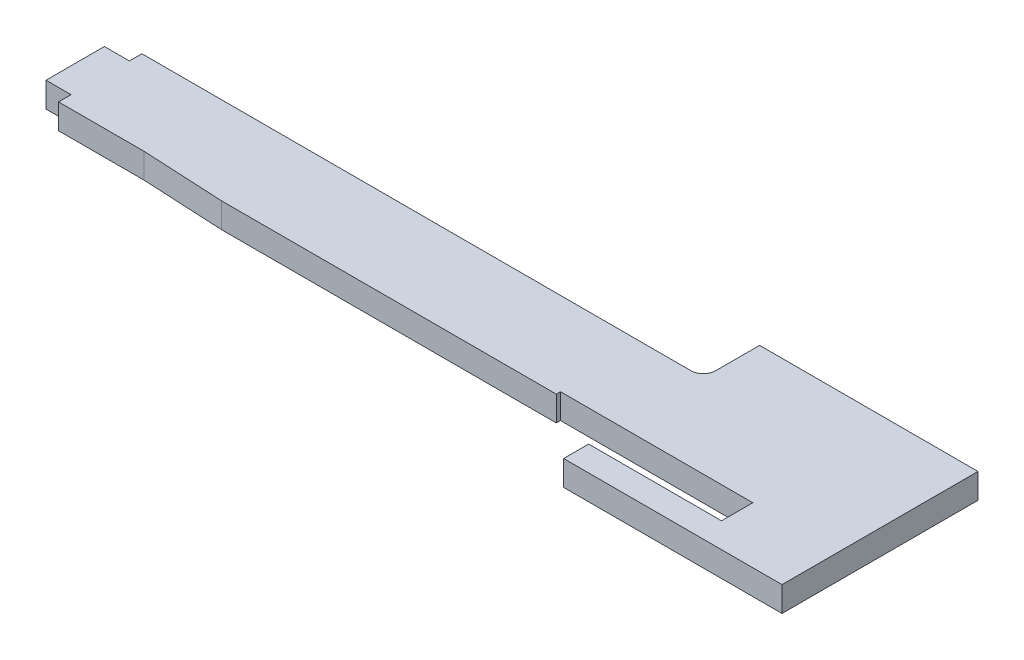
ISO-10303-21;
HEADER;
FILE_DESCRIPTION(('STEP AP214'),'2;1');
FILE_NAME('part.step','',(''),(''),'','','');
FILE_SCHEMA(('AUTOMOTIVE_DESIGN { 1 0 10303 214 1 1 1 1 }'));
ENDSEC;
DATA;
#1=APPLICATION_CONTEXT('core data for automotive mechanical design processes');
#2=APPLICATION_PROTOCOL_DEFINITION('international standard','automotive_design',2000,#1);
#3=PRODUCT_CONTEXT('',#1,'mechanical');
#4=PRODUCT('Part','Part','',(#3));
#5=PRODUCT_RELATED_PRODUCT_CATEGORY('part','',(#4));
#6=PRODUCT_DEFINITION_FORMATION('','',#4);
#7=PRODUCT_DEFINITION_CONTEXT('part definition',#1,'design');
#8=PRODUCT_DEFINITION('design','',#6,#7);
#9=PRODUCT_DEFINITION_SHAPE('','',#8);
#10=(LENGTH_UNIT() NAMED_UNIT(*) SI_UNIT(.MILLI.,.METRE.));
#11=(NAMED_UNIT(*) PLANE_ANGLE_UNIT() SI_UNIT($,.RADIAN.));
#12=(NAMED_UNIT(*) SI_UNIT($,.STERADIAN.) SOLID_ANGLE_UNIT());
#13=UNCERTAINTY_MEASURE_WITH_UNIT(LENGTH_MEASURE(1.E-05),#10,'distance_accuracy_value','');
#14=(GEOMETRIC_REPRESENTATION_CONTEXT(3) GLOBAL_UNCERTAINTY_ASSIGNED_CONTEXT((#13)) GLOBAL_UNIT_ASSIGNED_CONTEXT((#10,
#11,#12)) REPRESENTATION_CONTEXT('',''));
#15=CARTESIAN_POINT('',(0.,0.,0.));
#16=DIRECTION('',(0.,0.,1.));
#17=DIRECTION('',(1.,0.,0.));
#18=AXIS2_PLACEMENT_3D('',#15,#16,#17);
#19=CARTESIAN_POINT('',(-50.3732758055503,-114.131105205181,11.));
#20=DIRECTION('',(0.,0.,1.));
#21=DIRECTION('',(1.,0.,0.));
#22=AXIS2_PLACEMENT_3D('',#19,#20,#21);
#23=PLANE('',#22);
#24=DIRECTION('',(1.,0.,0.));
#25=VECTOR('',#24,1.);
#26=CARTESIAN_POINT('',(-50.3732758055503,0.,11.));
#27=LINE('',#26,#25);
#28=CARTESIAN_POINT('',(-50.3732758055503,0.,11.));
#29=VERTEX_POINT('',#28);
#30=CARTESIAN_POINT('',(29.8732758055504,0.,11.));
#31=VERTEX_POINT('',#30);
#32=EDGE_CURVE('E219',#29,#31,#27,.T.);
#33=ORIENTED_EDGE('',*,*,#32,.T.);
#34=DIRECTION('',(0.,1.,0.));
#35=VECTOR('',#34,1.);
#36=CARTESIAN_POINT('',(29.8732758055504,0.,11.));
#37=LINE('',#36,#35);
#38=CARTESIAN_POINT('',(29.8732758055503,6.00000000000001,11.));
#39=VERTEX_POINT('',#38);
#40=EDGE_CURVE('E172',#31,#39,#37,.T.);
#41=ORIENTED_EDGE('',*,*,#40,.T.);
#42=DIRECTION('',(1.,0.,0.));
#43=VECTOR('',#42,1.);
#44=CARTESIAN_POINT('',(-50.3732758055503,6.00000000000001,11.));
#45=LINE('',#44,#43);
#46=CARTESIAN_POINT('',(-50.3732758055503,6.00000000000001,11.));
#47=VERTEX_POINT('',#46);
#48=EDGE_CURVE('E210',#47,#39,#45,.T.);
#49=ORIENTED_EDGE('',*,*,#48,.F.);
#50=DIRECTION('',(0.,1.,0.));
#51=VECTOR('',#50,1.);
#52=CARTESIAN_POINT('',(-50.3732758055503,-114.131105205181,11.));
#53=LINE('',#52,#51);
#54=EDGE_CURVE('E218',#29,#47,#53,.T.);
#55=ORIENTED_EDGE('',*,*,#54,.F.);
#56=EDGE_LOOP('',(#33,#41,#49,#55));
#57=FACE_BOUND('',#56,.T.);
#58=ADVANCED_FACE('F37',(#57),#23,.T.);
#59=CARTESIAN_POINT('',(-96.5,6.00000000000001,-23.5));
#60=DIRECTION('',(1.,0.,0.));
#61=DIRECTION('',(0.,0.,-1.));
#62=AXIS2_PLACEMENT_3D('',#59,#60,#61);
#63=PLANE('',#62);
#64=DIRECTION('',(0.,1.,0.));
#65=VECTOR('',#64,1.);
#66=CARTESIAN_POINT('',(-96.5,0.,-7.));
#67=LINE('',#66,#65);
#68=CARTESIAN_POINT('',(-96.5,0.,-7.));
#69=VERTEX_POINT('',#68);
#70=CARTESIAN_POINT('',(-96.5,6.00000000000001,-7.));
#71=VERTEX_POINT('',#70);
#72=EDGE_CURVE('E238',#69,#71,#67,.T.);
#73=ORIENTED_EDGE('',*,*,#72,.F.);
#74=DIRECTION('',(0.,0.,1.));
#75=VECTOR('',#74,1.);
#76=CARTESIAN_POINT('',(-96.5,0.,-23.5));
#77=LINE('',#76,#75);
#78=CARTESIAN_POINT('',(-96.5,0.,7.));
#79=VERTEX_POINT('',#78);
#80=EDGE_CURVE('E289',#69,#79,#77,.T.);
#81=ORIENTED_EDGE('',*,*,#80,.T.);
#82=DIRECTION('',(0.,1.,0.));
#83=VECTOR('',#82,1.);
#84=CARTESIAN_POINT('',(-96.5,0.,7.));
#85=LINE('',#84,#83);
#86=CARTESIAN_POINT('',(-96.5,6.00000000000001,7.));
#87=VERTEX_POINT('',#86);
#88=EDGE_CURVE('E258',#79,#87,#85,.T.);
#89=ORIENTED_EDGE('',*,*,#88,.T.);
#90=DIRECTION('',(0.,0.,1.));
#91=VECTOR('',#90,1.);
#92=CARTESIAN_POINT('',(-96.5,6.00000000000001,-23.5));
#93=LINE('',#92,#91);
#94=EDGE_CURVE('E294',#71,#87,#93,.T.);
#95=ORIENTED_EDGE('',*,*,#94,.F.);
#96=EDGE_LOOP('',(#73,#81,#89,#95));
#97=FACE_BOUND('',#96,.T.);
#98=ADVANCED_FACE('F373',(#97),#63,.F.);
#99=CARTESIAN_POINT('',(-96.5,6.00000000000001,23.5));
#100=DIRECTION('',(0.,0.,-1.));
#101=DIRECTION('',(-1.,0.,0.));
#102=AXIS2_PLACEMENT_3D('',#99,#100,#101);
#103=PLANE('',#102);
#104=DIRECTION('',(0.,1.,0.));
#105=VECTOR('',#104,1.);
#106=CARTESIAN_POINT('',(44.1267241944497,0.,23.5));
#107=LINE('',#106,#105);
#108=CARTESIAN_POINT('',(44.1267241944497,0.,23.5));
#109=VERTEX_POINT('',#108);
#110=CARTESIAN_POINT('',(44.1267241944497,6.00000000000001,23.5));
#111=VERTEX_POINT('',#110);
#112=EDGE_CURVE('E235',#109,#111,#107,.T.);
#113=ORIENTED_EDGE('',*,*,#112,.F.);
#114=DIRECTION('',(1.,0.,0.));
#115=VECTOR('',#114,1.);
#116=CARTESIAN_POINT('',(-96.5,0.,23.5));
#117=LINE('',#116,#115);
#118=CARTESIAN_POINT('',(96.5,0.,23.5));
#119=VERTEX_POINT('',#118);
#120=EDGE_CURVE('E302',#109,#119,#117,.T.);
#121=ORIENTED_EDGE('',*,*,#120,.T.);
#122=DIRECTION('',(0.,-1.,0.));
#123=VECTOR('',#122,1.);
#124=CARTESIAN_POINT('',(96.5,6.00000000000001,23.5));
#125=LINE('',#124,#123);
#126=CARTESIAN_POINT('',(96.5,6.00000000000001,23.5));
#127=VERTEX_POINT('',#126);
#128=EDGE_CURVE('E306',#127,#119,#125,.T.);
#129=ORIENTED_EDGE('',*,*,#128,.F.);
#130=DIRECTION('',(1.,0.,0.));
#131=VECTOR('',#130,1.);
#132=CARTESIAN_POINT('',(-96.5,6.00000000000001,23.5));
#133=LINE('',#132,#131);
#134=EDGE_CURVE('E292',#111,#127,#133,.T.);
#135=ORIENTED_EDGE('',*,*,#134,.F.);
#136=EDGE_LOOP('',(#113,#121,#129,#135));
#137=FACE_BOUND('',#136,.T.);
#138=ADVANCED_FACE('F342',(#137),#103,.F.);
#139=CARTESIAN_POINT('',(0.,6.00000000000001,0.));
#140=DIRECTION('',(0.,-1.,0.));
#141=DIRECTION('',(0.,0.,-1.));
#142=AXIS2_PLACEMENT_3D('',#139,#140,#141);
#143=PLANE('',#142);
#144=DIRECTION('',(0.,0.,-1.));
#145=VECTOR('',#144,1.);
#146=CARTESIAN_POINT('',(76.,6.00000000000001,0.));
#147=LINE('',#146,#145);
#148=CARTESIAN_POINT('',(76.,6.00000000000001,17.5));
#149=VERTEX_POINT('',#148);
#150=CARTESIAN_POINT('',(76.,6.00000000000001,10.));
#151=VERTEX_POINT('',#150);
#152=EDGE_CURVE('E190',#149,#151,#147,.T.);
#153=ORIENTED_EDGE('',*,*,#152,.F.);
#154=DIRECTION('',(1.,0.,0.));
#155=VECTOR('',#154,1.);
#156=CARTESIAN_POINT('',(0.,6.00000000000001,17.5));
#157=LINE('',#156,#155);
#158=CARTESIAN_POINT('',(44.1267241944497,6.00000000000001,17.5));
#159=VERTEX_POINT('',#158);
#160=EDGE_CURVE('E193',#159,#149,#157,.T.);
#161=ORIENTED_EDGE('',*,*,#160,.F.);
#162=DIRECTION('',(0.,0.,-1.));
#163=VECTOR('',#162,1.);
#164=CARTESIAN_POINT('',(44.1267241944497,6.00000000000001,9.99999999999999));
#165=LINE('',#164,#163);
#166=EDGE_CURVE('E269',#111,#159,#165,.T.);
#167=ORIENTED_EDGE('',*,*,#166,.F.);
#168=ORIENTED_EDGE('',*,*,#134,.T.);
#169=DIRECTION('',(0.,0.,1.));
#170=VECTOR('',#169,1.);
#171=CARTESIAN_POINT('',(96.5,6.00000000000001,-23.5));
#172=LINE('',#171,#170);
#173=CARTESIAN_POINT('',(96.5,6.00000000000001,-23.5));
#174=VERTEX_POINT('',#173);
#175=EDGE_CURVE('E288',#174,#127,#172,.T.);
#176=ORIENTED_EDGE('',*,*,#175,.F.);
#177=DIRECTION('',(1.,0.,0.));
#178=VECTOR('',#177,1.);
#179=CARTESIAN_POINT('',(-96.5,6.00000000000001,-23.5));
#180=LINE('',#179,#178);
#181=CARTESIAN_POINT('',(44.1267241944497,6.00000000000001,-23.5));
#182=VERTEX_POINT('',#181);
#183=EDGE_CURVE('E286',#182,#174,#180,.T.);
#184=ORIENTED_EDGE('',*,*,#183,.F.);
#185=DIRECTION('',(0.,0.,-1.));
#186=VECTOR('',#185,1.);
#187=CARTESIAN_POINT('',(44.1267241944497,6.00000000000001,-17.5));
#188=LINE('',#187,#186);
#189=CARTESIAN_POINT('',(44.1267241944497,6.00000000000001,-13.));
#190=VERTEX_POINT('',#189);
#191=EDGE_CURVE('E272',#190,#182,#188,.T.);
#192=ORIENTED_EDGE('',*,*,#191,.F.);
#193=CARTESIAN_POINT('',(41.1267241944497,6.00000000000001,-13.));
#194=DIRECTION('',(0.,-1.,0.));
#195=DIRECTION('',(0.,0.,-1.));
#196=AXIS2_PLACEMENT_3D('',#193,#194,#195);
#197=CIRCLE('',#196,3.);
#198=CARTESIAN_POINT('',(41.1267241944497,6.00000000000001,-10.));
#199=VERTEX_POINT('',#198);
#200=EDGE_CURVE('E45',#190,#199,#197,.T.);
#201=ORIENTED_EDGE('',*,*,#200,.T.);
#202=DIRECTION('',(1.,0.,0.));
#203=VECTOR('',#202,1.);
#204=CARTESIAN_POINT('',(-90.5,6.00000000000001,-10.));
#205=LINE('',#204,#203);
#206=CARTESIAN_POINT('',(-90.5,6.00000000000001,-10.));
#207=VERTEX_POINT('',#206);
#208=EDGE_CURVE('E280',#207,#199,#205,.T.);
#209=ORIENTED_EDGE('',*,*,#208,.F.);
#210=DIRECTION('',(0.,0.,1.));
#211=VECTOR('',#210,1.);
#212=CARTESIAN_POINT('',(-90.5,6.00000000000001,0.));
#213=LINE('',#212,#211);
#214=CARTESIAN_POINT('',(-90.5,6.00000000000001,-7.));
#215=VERTEX_POINT('',#214);
#216=EDGE_CURVE('E229',#207,#215,#213,.T.);
#217=ORIENTED_EDGE('',*,*,#216,.T.);
#218=DIRECTION('',(-1.,0.,0.));
#219=VECTOR('',#218,1.);
#220=CARTESIAN_POINT('',(0.,6.00000000000001,-7.));
#221=LINE('',#220,#219);
#222=EDGE_CURVE('E232',#215,#71,#221,.T.);
#223=ORIENTED_EDGE('',*,*,#222,.T.);
#224=ORIENTED_EDGE('',*,*,#94,.T.);
#225=DIRECTION('',(1.,0.,0.));
#226=VECTOR('',#225,1.);
#227=CARTESIAN_POINT('',(0.,6.00000000000001,7.00000000000001));
#228=LINE('',#227,#226);
#229=CARTESIAN_POINT('',(-90.5,6.00000000000001,7.));
#230=VERTEX_POINT('',#229);
#231=EDGE_CURVE('E249',#87,#230,#228,.T.);
#232=ORIENTED_EDGE('',*,*,#231,.T.);
#233=DIRECTION('',(0.,0.,1.));
#234=VECTOR('',#233,1.);
#235=CARTESIAN_POINT('',(-90.5,6.00000000000001,0.));
#236=LINE('',#235,#234);
#237=CARTESIAN_POINT('',(-90.5,6.00000000000001,10.));
#238=VERTEX_POINT('',#237);
#239=EDGE_CURVE('E225',#230,#238,#236,.T.);
#240=ORIENTED_EDGE('',*,*,#239,.T.);
#241=DIRECTION('',(-1.,0.,0.));
#242=VECTOR('',#241,1.);
#243=CARTESIAN_POINT('',(44.1267241944497,6.00000000000001,9.99999999999999));
#244=LINE('',#243,#242);
#245=CARTESIAN_POINT('',(-70.000000000002,6.00000000000001,10.));
#246=VERTEX_POINT('',#245);
#247=EDGE_CURVE('E266',#246,#238,#244,.T.);
#248=ORIENTED_EDGE('',*,*,#247,.F.);
#249=DIRECTION('',(0.998704522725528,0.,0.0508849318322744));
#250=VECTOR('',#249,1.);
#251=CARTESIAN_POINT('',(-70.,6.00000000000001,10.0000000000001));
#252=LINE('',#251,#250);
#253=EDGE_CURVE('E204',#246,#47,#252,.T.);
#254=ORIENTED_EDGE('',*,*,#253,.T.);
#255=ORIENTED_EDGE('',*,*,#48,.T.);
#256=DIRECTION('',(0.,0.,-1.));
#257=VECTOR('',#256,1.);
#258=CARTESIAN_POINT('',(29.8732758055504,6.00000000000001,0.));
#259=LINE('',#258,#257);
#260=CARTESIAN_POINT('',(29.8732758055504,6.00000000000001,10.));
#261=VERTEX_POINT('',#260);
#262=EDGE_CURVE('E52',#39,#261,#259,.T.);
#263=ORIENTED_EDGE('',*,*,#262,.T.);
#264=DIRECTION('',(1.,0.,0.));
#265=VECTOR('',#264,1.);
#266=CARTESIAN_POINT('',(0.,6.00000000000001,9.99999999999999));
#267=LINE('',#266,#265);
#268=EDGE_CURVE('E183',#261,#151,#267,.T.);
#269=ORIENTED_EDGE('',*,*,#268,.T.);
#270=EDGE_LOOP('',(#153,#161,#167,#168,#176,#184,#192,#201,#209,#217,#223,#224,#232,#240,#248,
#254,#255,#263,#269));
#271=FACE_BOUND('',#270,.T.);
#272=ADVANCED_FACE('F318',(#271),#143,.F.);
#273=CARTESIAN_POINT('',(0.,0.,0.));
#274=DIRECTION('',(0.,-1.,0.));
#275=DIRECTION('',(0.,0.,-1.));
#276=AXIS2_PLACEMENT_3D('',#273,#274,#275);
#277=PLANE('',#276);
#278=DIRECTION('',(1.,0.,0.));
#279=VECTOR('',#278,1.);
#280=CARTESIAN_POINT('',(0.,0.,17.5));
#281=LINE('',#280,#279);
#282=CARTESIAN_POINT('',(44.1267241944497,0.,17.5));
#283=VERTEX_POINT('',#282);
#284=CARTESIAN_POINT('',(76.,0.,17.5));
#285=VERTEX_POINT('',#284);
#286=EDGE_CURVE('E176',#283,#285,#281,.T.);
#287=ORIENTED_EDGE('',*,*,#286,.T.);
#288=DIRECTION('',(0.,0.,-1.));
#289=VECTOR('',#288,1.);
#290=CARTESIAN_POINT('',(76.,0.,0.));
#291=LINE('',#290,#289);
#292=CARTESIAN_POINT('',(76.,0.,10.));
#293=VERTEX_POINT('',#292);
#294=EDGE_CURVE('E184',#285,#293,#291,.T.);
#295=ORIENTED_EDGE('',*,*,#294,.T.);
#296=DIRECTION('',(1.,0.,0.));
#297=VECTOR('',#296,1.);
#298=CARTESIAN_POINT('',(0.,0.,9.99999999999999));
#299=LINE('',#298,#297);
#300=CARTESIAN_POINT('',(29.8732758055504,0.,10.));
#301=VERTEX_POINT('',#300);
#302=EDGE_CURVE('E177',#301,#293,#299,.T.);
#303=ORIENTED_EDGE('',*,*,#302,.F.);
#304=DIRECTION('',(0.,0.,-1.));
#305=VECTOR('',#304,1.);
#306=CARTESIAN_POINT('',(29.8732758055504,0.,0.));
#307=LINE('',#306,#305);
#308=EDGE_CURVE('E167',#31,#301,#307,.T.);
#309=ORIENTED_EDGE('',*,*,#308,.F.);
#310=ORIENTED_EDGE('',*,*,#32,.F.);
#311=DIRECTION('',(0.998704522725528,0.,0.0508849318322744));
#312=VECTOR('',#311,1.);
#313=CARTESIAN_POINT('',(-70.,0.,10.0000000000001));
#314=LINE('',#313,#312);
#315=CARTESIAN_POINT('',(-70.,0.,10.0000000000001));
#316=VERTEX_POINT('',#315);
#317=EDGE_CURVE('E213',#316,#29,#314,.T.);
#318=ORIENTED_EDGE('',*,*,#317,.F.);
#319=DIRECTION('',(-1.,0.,0.));
#320=VECTOR('',#319,1.);
#321=CARTESIAN_POINT('',(44.1267241944497,0.,9.99999999999999));
#322=LINE('',#321,#320);
#323=CARTESIAN_POINT('',(-90.5,0.,10.));
#324=VERTEX_POINT('',#323);
#325=EDGE_CURVE('E265',#316,#324,#322,.T.);
#326=ORIENTED_EDGE('',*,*,#325,.T.);
#327=DIRECTION('',(0.,0.,1.));
#328=VECTOR('',#327,1.);
#329=CARTESIAN_POINT('',(-90.5,0.,0.));
#330=LINE('',#329,#328);
#331=CARTESIAN_POINT('',(-90.5,0.,7.));
#332=VERTEX_POINT('',#331);
#333=EDGE_CURVE('E245',#332,#324,#330,.T.);
#334=ORIENTED_EDGE('',*,*,#333,.F.);
#335=DIRECTION('',(1.,0.,0.));
#336=VECTOR('',#335,1.);
#337=CARTESIAN_POINT('',(0.,0.,7.00000000000001));
#338=LINE('',#337,#336);
#339=EDGE_CURVE('E248',#79,#332,#338,.T.);
#340=ORIENTED_EDGE('',*,*,#339,.F.);
#341=ORIENTED_EDGE('',*,*,#80,.F.);
#342=DIRECTION('',(-1.,0.,0.));
#343=VECTOR('',#342,1.);
#344=CARTESIAN_POINT('',(0.,0.,-7.));
#345=LINE('',#344,#343);
#346=CARTESIAN_POINT('',(-90.5,0.,-7.));
#347=VERTEX_POINT('',#346);
#348=EDGE_CURVE('E226',#347,#69,#345,.T.);
#349=ORIENTED_EDGE('',*,*,#348,.F.);
#350=DIRECTION('',(0.,0.,1.));
#351=VECTOR('',#350,1.);
#352=CARTESIAN_POINT('',(-90.5,0.,0.));
#353=LINE('',#352,#351);
#354=CARTESIAN_POINT('',(-90.5,0.,-10.));
#355=VERTEX_POINT('',#354);
#356=EDGE_CURVE('E228',#355,#347,#353,.T.);
#357=ORIENTED_EDGE('',*,*,#356,.F.);
#358=DIRECTION('',(1.,0.,0.));
#359=VECTOR('',#358,1.);
#360=CARTESIAN_POINT('',(-90.5,0.,-10.));
#361=LINE('',#360,#359);
#362=CARTESIAN_POINT('',(41.1267241944497,0.,-10.));
#363=VERTEX_POINT('',#362);
#364=EDGE_CURVE('E279',#355,#363,#361,.T.);
#365=ORIENTED_EDGE('',*,*,#364,.T.);
#366=CARTESIAN_POINT('',(41.1267241944497,0.,-13.));
#367=DIRECTION('',(0.,-1.,0.));
#368=DIRECTION('',(0.,0.,-1.));
#369=AXIS2_PLACEMENT_3D('',#366,#367,#368);
#370=CIRCLE('',#369,3.);
#371=CARTESIAN_POINT('',(44.1267241944497,0.,-13.));
#372=VERTEX_POINT('',#371);
#373=EDGE_CURVE('E11',#363,#372,#370,.F.);
#374=ORIENTED_EDGE('',*,*,#373,.T.);
#375=DIRECTION('',(0.,0.,-1.));
#376=VECTOR('',#375,1.);
#377=CARTESIAN_POINT('',(44.1267241944497,0.,-17.5));
#378=LINE('',#377,#376);
#379=CARTESIAN_POINT('',(44.1267241944497,0.,-23.5));
#380=VERTEX_POINT('',#379);
#381=EDGE_CURVE('E282',#372,#380,#378,.T.);
#382=ORIENTED_EDGE('',*,*,#381,.T.);
#383=DIRECTION('',(1.,0.,0.));
#384=VECTOR('',#383,1.);
#385=CARTESIAN_POINT('',(-96.5,0.,-23.5));
#386=LINE('',#385,#384);
#387=CARTESIAN_POINT('',(96.5,0.,-23.5));
#388=VERTEX_POINT('',#387);
#389=EDGE_CURVE('E276',#380,#388,#386,.T.);
#390=ORIENTED_EDGE('',*,*,#389,.T.);
#391=DIRECTION('',(0.,0.,1.));
#392=VECTOR('',#391,1.);
#393=CARTESIAN_POINT('',(96.5,0.,-23.5));
#394=LINE('',#393,#392);
#395=EDGE_CURVE('E299',#388,#119,#394,.T.);
#396=ORIENTED_EDGE('',*,*,#395,.T.);
#397=ORIENTED_EDGE('',*,*,#120,.F.);
#398=DIRECTION('',(0.,0.,-1.));
#399=VECTOR('',#398,1.);
#400=CARTESIAN_POINT('',(44.1267241944497,0.,9.99999999999999));
#401=LINE('',#400,#399);
#402=EDGE_CURVE('E262',#109,#283,#401,.T.);
#403=ORIENTED_EDGE('',*,*,#402,.T.);
#404=EDGE_LOOP('',(#287,#295,#303,#309,#310,#318,#326,#334,#340,#341,#349,#357,#365,#374,#382,
#390,#396,#397,#403));
#405=FACE_BOUND('',#404,.T.);
#406=ADVANCED_FACE('F188',(#405),#277,.T.);
#407=CARTESIAN_POINT('',(-96.5,6.00000000000001,-23.5));
#408=DIRECTION('',(0.,0.,-1.));
#409=DIRECTION('',(-1.,0.,0.));
#410=AXIS2_PLACEMENT_3D('',#407,#408,#409);
#411=PLANE('',#410);
#412=DIRECTION('',(0.,1.,0.));
#413=VECTOR('',#412,1.);
#414=CARTESIAN_POINT('',(44.1267241944497,0.,-23.5));
#415=LINE('',#414,#413);
#416=EDGE_CURVE('E241',#380,#182,#415,.T.);
#417=ORIENTED_EDGE('',*,*,#416,.T.);
#418=ORIENTED_EDGE('',*,*,#183,.T.);
#419=DIRECTION('',(0.,-1.,0.));
#420=VECTOR('',#419,1.);
#421=CARTESIAN_POINT('',(96.5,6.00000000000001,-23.5));
#422=LINE('',#421,#420);
#423=EDGE_CURVE('E297',#174,#388,#422,.T.);
#424=ORIENTED_EDGE('',*,*,#423,.T.);
#425=ORIENTED_EDGE('',*,*,#389,.F.);
#426=EDGE_LOOP('',(#417,#418,#424,#425));
#427=FACE_BOUND('',#426,.T.);
#428=ADVANCED_FACE('F331',(#427),#411,.T.);
#429=CARTESIAN_POINT('',(96.5,6.00000000000001,-23.5));
#430=DIRECTION('',(1.,0.,0.));
#431=DIRECTION('',(0.,0.,-1.));
#432=AXIS2_PLACEMENT_3D('',#429,#430,#431);
#433=PLANE('',#432);
#434=ORIENTED_EDGE('',*,*,#395,.F.);
#435=ORIENTED_EDGE('',*,*,#423,.F.);
#436=ORIENTED_EDGE('',*,*,#175,.T.);
#437=ORIENTED_EDGE('',*,*,#128,.T.);
#438=EDGE_LOOP('',(#434,#435,#436,#437));
#439=FACE_BOUND('',#438,.T.);
#440=ADVANCED_FACE('F336',(#439),#433,.T.);
#441=CARTESIAN_POINT('',(44.1267241944497,0.,-17.5));
#442=DIRECTION('',(1.,0.,0.));
#443=DIRECTION('',(0.,0.,-1.));
#444=AXIS2_PLACEMENT_3D('',#441,#442,#443);
#445=PLANE('',#444);
#446=ORIENTED_EDGE('',*,*,#381,.F.);
#447=DIRECTION('',(0.,1.,0.));
#448=VECTOR('',#447,1.);
#449=CARTESIAN_POINT('',(44.1267241944497,6.00000000000001,-13.));
#450=LINE('',#449,#448);
#451=EDGE_CURVE('E309',#372,#190,#450,.T.);
#452=ORIENTED_EDGE('',*,*,#451,.T.);
#453=ORIENTED_EDGE('',*,*,#191,.T.);
#454=ORIENTED_EDGE('',*,*,#416,.F.);
#455=EDGE_LOOP('',(#446,#452,#453,#454));
#456=FACE_BOUND('',#455,.T.);
#457=ADVANCED_FACE('F328',(#456),#445,.F.);
#458=CARTESIAN_POINT('',(-90.5,0.,-10.));
#459=DIRECTION('',(0.,0.,1.));
#460=DIRECTION('',(1.,0.,0.));
#461=AXIS2_PLACEMENT_3D('',#458,#459,#460);
#462=PLANE('',#461);
#463=ORIENTED_EDGE('',*,*,#208,.T.);
#464=DIRECTION('',(0.,1.,0.));
#465=VECTOR('',#464,1.);
#466=CARTESIAN_POINT('',(41.1267241944497,0.,-10.));
#467=LINE('',#466,#465);
#468=EDGE_CURVE('E60',#199,#363,#467,.F.);
#469=ORIENTED_EDGE('',*,*,#468,.T.);
#470=ORIENTED_EDGE('',*,*,#364,.F.);
#471=DIRECTION('',(0.,1.,0.));
#472=VECTOR('',#471,1.);
#473=CARTESIAN_POINT('',(-90.5,0.,-10.));
#474=LINE('',#473,#472);
#475=EDGE_CURVE('E240',#355,#207,#474,.T.);
#476=ORIENTED_EDGE('',*,*,#475,.T.);
#477=EDGE_LOOP('',(#463,#469,#470,#476));
#478=FACE_BOUND('',#477,.T.);
#479=ADVANCED_FACE('F322',(#478),#462,.F.);
#480=CARTESIAN_POINT('',(44.1267241944497,0.,9.99999999999999));
#481=DIRECTION('',(1.,0.,0.));
#482=DIRECTION('',(0.,0.,-1.));
#483=AXIS2_PLACEMENT_3D('',#480,#481,#482);
#484=PLANE('',#483);
#485=ORIENTED_EDGE('',*,*,#166,.T.);
#486=DIRECTION('',(0.,1.,0.));
#487=VECTOR('',#486,1.);
#488=CARTESIAN_POINT('',(44.1267241944497,0.,17.5));
#489=LINE('',#488,#487);
#490=EDGE_CURVE('E207',#283,#159,#489,.T.);
#491=ORIENTED_EDGE('',*,*,#490,.F.);
#492=ORIENTED_EDGE('',*,*,#402,.F.);
#493=ORIENTED_EDGE('',*,*,#112,.T.);
#494=EDGE_LOOP('',(#485,#491,#492,#493));
#495=FACE_BOUND('',#494,.T.);
#496=ADVANCED_FACE('F344',(#495),#484,.F.);
#497=CARTESIAN_POINT('',(44.1267241944497,0.,9.99999999999999));
#498=DIRECTION('',(0.,0.,-1.));
#499=DIRECTION('',(-1.,0.,0.));
#500=AXIS2_PLACEMENT_3D('',#497,#498,#499);
#501=PLANE('',#500);
#502=ORIENTED_EDGE('',*,*,#325,.F.);
#503=DIRECTION('',(0.,1.,0.));
#504=VECTOR('',#503,1.);
#505=CARTESIAN_POINT('',(-70.,-114.131105205181,10.0000000000001));
#506=LINE('',#505,#504);
#507=EDGE_CURVE('E221',#316,#246,#506,.T.);
#508=ORIENTED_EDGE('',*,*,#507,.T.);
#509=ORIENTED_EDGE('',*,*,#247,.T.);
#510=DIRECTION('',(0.,1.,0.));
#511=VECTOR('',#510,1.);
#512=CARTESIAN_POINT('',(-90.5,0.,10.));
#513=LINE('',#512,#511);
#514=EDGE_CURVE('E268',#324,#238,#513,.T.);
#515=ORIENTED_EDGE('',*,*,#514,.F.);
#516=EDGE_LOOP('',(#502,#508,#509,#515));
#517=FACE_BOUND('',#516,.T.);
#518=ADVANCED_FACE('F362',(#517),#501,.F.);
#519=CARTESIAN_POINT('',(-90.5,0.,0.));
#520=DIRECTION('',(-1.,0.,0.));
#521=DIRECTION('',(0.,0.,1.));
#522=AXIS2_PLACEMENT_3D('',#519,#520,#521);
#523=PLANE('',#522);
#524=ORIENTED_EDGE('',*,*,#514,.T.);
#525=ORIENTED_EDGE('',*,*,#239,.F.);
#526=DIRECTION('',(0.,1.,0.));
#527=VECTOR('',#526,1.);
#528=CARTESIAN_POINT('',(-90.5,0.,7.));
#529=LINE('',#528,#527);
#530=EDGE_CURVE('E251',#332,#230,#529,.T.);
#531=ORIENTED_EDGE('',*,*,#530,.F.);
#532=ORIENTED_EDGE('',*,*,#333,.T.);
#533=EDGE_LOOP('',(#524,#525,#531,#532));
#534=FACE_BOUND('',#533,.T.);
#535=ADVANCED_FACE('F365',(#534),#523,.T.);
#536=CARTESIAN_POINT('',(0.,0.,7.00000000000001));
#537=DIRECTION('',(0.,0.,1.));
#538=DIRECTION('',(1.,0.,0.));
#539=AXIS2_PLACEMENT_3D('',#536,#537,#538);
#540=PLANE('',#539);
#541=ORIENTED_EDGE('',*,*,#231,.F.);
#542=ORIENTED_EDGE('',*,*,#88,.F.);
#543=ORIENTED_EDGE('',*,*,#339,.T.);
#544=ORIENTED_EDGE('',*,*,#530,.T.);
#545=EDGE_LOOP('',(#541,#542,#543,#544));
#546=FACE_BOUND('',#545,.T.);
#547=ADVANCED_FACE('F369',(#546),#540,.T.);
#548=CARTESIAN_POINT('',(-90.5,0.,0.));
#549=DIRECTION('',(-1.,0.,0.));
#550=DIRECTION('',(0.,0.,1.));
#551=AXIS2_PLACEMENT_3D('',#548,#549,#550);
#552=PLANE('',#551);
#553=ORIENTED_EDGE('',*,*,#475,.F.);
#554=ORIENTED_EDGE('',*,*,#356,.T.);
#555=DIRECTION('',(0.,1.,0.));
#556=VECTOR('',#555,1.);
#557=CARTESIAN_POINT('',(-90.5,0.,-7.));
#558=LINE('',#557,#556);
#559=EDGE_CURVE('E231',#347,#215,#558,.T.);
#560=ORIENTED_EDGE('',*,*,#559,.T.);
#561=ORIENTED_EDGE('',*,*,#216,.F.);
#562=EDGE_LOOP('',(#553,#554,#560,#561));
#563=FACE_BOUND('',#562,.T.);
#564=ADVANCED_FACE('F381',(#563),#552,.T.);
#565=CARTESIAN_POINT('',(0.,0.,-7.));
#566=DIRECTION('',(0.,0.,-1.));
#567=DIRECTION('',(-1.,0.,0.));
#568=AXIS2_PLACEMENT_3D('',#565,#566,#567);
#569=PLANE('',#568);
#570=ORIENTED_EDGE('',*,*,#222,.F.);
#571=ORIENTED_EDGE('',*,*,#559,.F.);
#572=ORIENTED_EDGE('',*,*,#348,.T.);
#573=ORIENTED_EDGE('',*,*,#72,.T.);
#574=EDGE_LOOP('',(#570,#571,#572,#573));
#575=FACE_BOUND('',#574,.T.);
#576=ADVANCED_FACE('F379',(#575),#569,.T.);
#577=CARTESIAN_POINT('',(-70.,-114.131105205181,10.0000000000001));
#578=DIRECTION('',(-0.0508849318322744,0.,0.998704522725528));
#579=DIRECTION('',(0.998704522725528,0.,0.0508849318322744));
#580=AXIS2_PLACEMENT_3D('',#577,#578,#579);
#581=PLANE('',#580);
#582=ORIENTED_EDGE('',*,*,#507,.F.);
#583=ORIENTED_EDGE('',*,*,#317,.T.);
#584=ORIENTED_EDGE('',*,*,#54,.T.);
#585=ORIENTED_EDGE('',*,*,#253,.F.);
#586=EDGE_LOOP('',(#582,#583,#584,#585));
#587=FACE_BOUND('',#586,.T.);
#588=ADVANCED_FACE('F359',(#587),#581,.T.);
#589=CARTESIAN_POINT('',(41.1267241944497,0.,-13.));
#590=DIRECTION('',(0.,-1.,0.));
#591=DIRECTION('',(0.,0.,-1.));
#592=AXIS2_PLACEMENT_3D('',#589,#590,#591);
#593=CYLINDRICAL_SURFACE('',#592,3.);
#594=ORIENTED_EDGE('',*,*,#373,.F.);
#595=ORIENTED_EDGE('',*,*,#468,.F.);
#596=ORIENTED_EDGE('',*,*,#200,.F.);
#597=ORIENTED_EDGE('',*,*,#451,.F.);
#598=EDGE_LOOP('',(#594,#595,#596,#597));
#599=FACE_BOUND('',#598,.T.);
#600=ADVANCED_FACE('F39',(#599),#593,.F.);
#601=CARTESIAN_POINT('',(0.,0.,9.99999999999999));
#602=DIRECTION('',(0.,0.,1.));
#603=DIRECTION('',(1.,0.,0.));
#604=AXIS2_PLACEMENT_3D('',#601,#602,#603);
#605=PLANE('',#604);
#606=ORIENTED_EDGE('',*,*,#268,.F.);
#607=DIRECTION('',(0.,1.,0.));
#608=VECTOR('',#607,1.);
#609=CARTESIAN_POINT('',(29.8732758055504,0.,10.));
#610=LINE('',#609,#608);
#611=EDGE_CURVE('E170',#301,#261,#610,.T.);
#612=ORIENTED_EDGE('',*,*,#611,.F.);
#613=ORIENTED_EDGE('',*,*,#302,.T.);
#614=DIRECTION('',(0.,1.,0.));
#615=VECTOR('',#614,1.);
#616=CARTESIAN_POINT('',(76.,0.,10.));
#617=LINE('',#616,#615);
#618=EDGE_CURVE('E202',#293,#151,#617,.T.);
#619=ORIENTED_EDGE('',*,*,#618,.T.);
#620=EDGE_LOOP('',(#606,#612,#613,#619));
#621=FACE_BOUND('',#620,.T.);
#622=ADVANCED_FACE('F180',(#621),#605,.T.);
#623=CARTESIAN_POINT('',(76.,0.,0.));
#624=DIRECTION('',(1.,0.,0.));
#625=DIRECTION('',(0.,0.,-1.));
#626=AXIS2_PLACEMENT_3D('',#623,#624,#625);
#627=PLANE('',#626);
#628=ORIENTED_EDGE('',*,*,#152,.T.);
#629=ORIENTED_EDGE('',*,*,#618,.F.);
#630=ORIENTED_EDGE('',*,*,#294,.F.);
#631=DIRECTION('',(0.,1.,0.));
#632=VECTOR('',#631,1.);
#633=CARTESIAN_POINT('',(76.,0.,17.5));
#634=LINE('',#633,#632);
#635=EDGE_CURVE('E205',#285,#149,#634,.T.);
#636=ORIENTED_EDGE('',*,*,#635,.T.);
#637=EDGE_LOOP('',(#628,#629,#630,#636));
#638=FACE_BOUND('',#637,.T.);
#639=ADVANCED_FACE('F350',(#638),#627,.F.);
#640=CARTESIAN_POINT('',(0.,0.,17.5));
#641=DIRECTION('',(0.,0.,1.));
#642=DIRECTION('',(1.,0.,0.));
#643=AXIS2_PLACEMENT_3D('',#640,#641,#642);
#644=PLANE('',#643);
#645=ORIENTED_EDGE('',*,*,#160,.T.);
#646=ORIENTED_EDGE('',*,*,#635,.F.);
#647=ORIENTED_EDGE('',*,*,#286,.F.);
#648=ORIENTED_EDGE('',*,*,#490,.T.);
#649=EDGE_LOOP('',(#645,#646,#647,#648));
#650=FACE_BOUND('',#649,.T.);
#651=ADVANCED_FACE('F347',(#650),#644,.F.);
#652=CARTESIAN_POINT('',(29.8732758055504,0.,0.));
#653=DIRECTION('',(1.,0.,0.));
#654=DIRECTION('',(0.,0.,-1.));
#655=AXIS2_PLACEMENT_3D('',#652,#653,#654);
#656=PLANE('',#655);
#657=ORIENTED_EDGE('',*,*,#262,.F.);
#658=ORIENTED_EDGE('',*,*,#40,.F.);
#659=ORIENTED_EDGE('',*,*,#308,.T.);
#660=ORIENTED_EDGE('',*,*,#611,.T.);
#661=EDGE_LOOP('',(#657,#658,#659,#660));
#662=FACE_BOUND('',#661,.T.);
#663=ADVANCED_FACE('F169',(#662),#656,.T.);
#664=CLOSED_SHELL('',(#58,#98,#138,#272,#406,#428,#440,#457,#479,#496,#518,#535,#547,#564,#576,
#588,#600,#622,#639,#651,#663));
#665=MANIFOLD_SOLID_BREP('B2',#664);
#666=ADVANCED_BREP_SHAPE_REPRESENTATION('',(#18,#665),#14);
#667=SHAPE_DEFINITION_REPRESENTATION(#9,#666);
ENDSEC;
END-ISO-10303-21;
